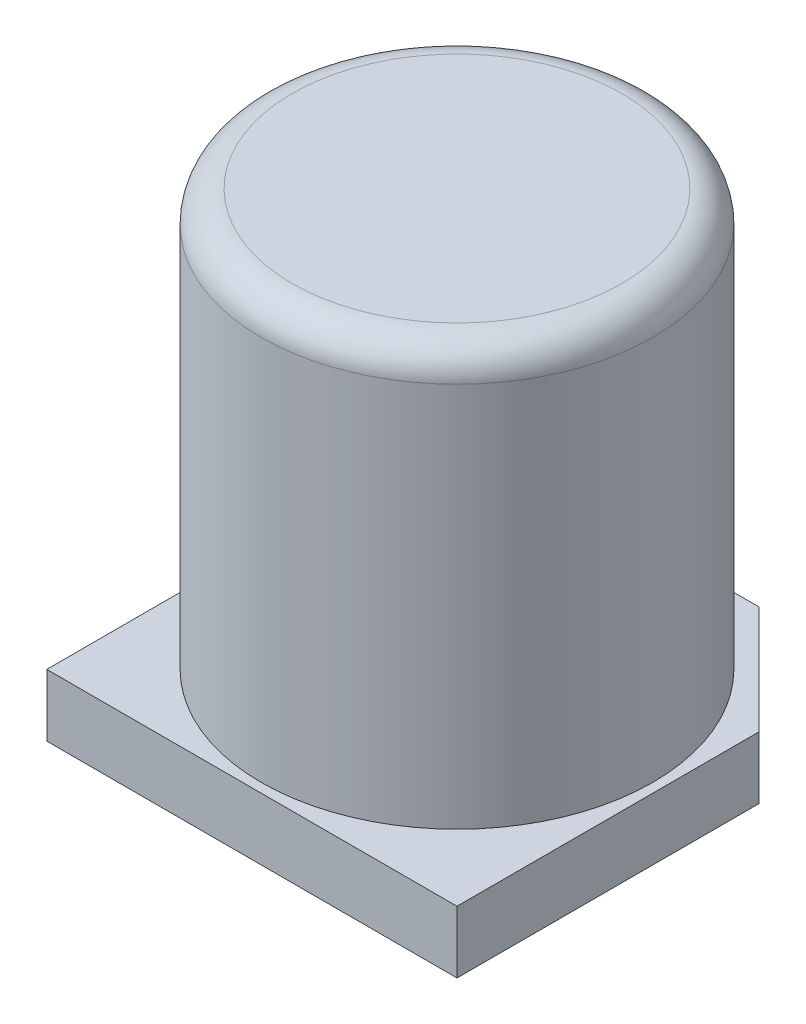
ISO-10303-21;
HEADER;
FILE_DESCRIPTION(('STEP AP214'),'2;1');
FILE_NAME('part.step','',(''),(''),'','','');
FILE_SCHEMA(('AUTOMOTIVE_DESIGN { 1 0 10303 214 1 1 1 1 }'));
ENDSEC;
DATA;
#1=APPLICATION_CONTEXT('core data for automotive mechanical design processes');
#2=APPLICATION_PROTOCOL_DEFINITION('international standard','automotive_design',2000,#1);
#3=PRODUCT_CONTEXT('',#1,'mechanical');
#4=PRODUCT('Part','Part','',(#3));
#5=PRODUCT_RELATED_PRODUCT_CATEGORY('part','',(#4));
#6=PRODUCT_DEFINITION_FORMATION('','',#4);
#7=PRODUCT_DEFINITION_CONTEXT('part definition',#1,'design');
#8=PRODUCT_DEFINITION('design','',#6,#7);
#9=PRODUCT_DEFINITION_SHAPE('','',#8);
#10=(LENGTH_UNIT() NAMED_UNIT(*) SI_UNIT(.MILLI.,.METRE.));
#11=(NAMED_UNIT(*) PLANE_ANGLE_UNIT() SI_UNIT($,.RADIAN.));
#12=(NAMED_UNIT(*) SI_UNIT($,.STERADIAN.) SOLID_ANGLE_UNIT());
#13=UNCERTAINTY_MEASURE_WITH_UNIT(LENGTH_MEASURE(1.E-05),#10,'distance_accuracy_value','');
#14=(GEOMETRIC_REPRESENTATION_CONTEXT(3) GLOBAL_UNCERTAINTY_ASSIGNED_CONTEXT((#13)) GLOBAL_UNIT_ASSIGNED_CONTEXT((#10,
#11,#12)) REPRESENTATION_CONTEXT('',''));
#15=CARTESIAN_POINT('',(0.,0.,0.));
#16=DIRECTION('',(0.,0.,1.));
#17=DIRECTION('',(1.,0.,0.));
#18=AXIS2_PLACEMENT_3D('',#15,#16,#17);
#19=CARTESIAN_POINT('',(-7.40142135623731,1.,0.));
#20=DIRECTION('',(0.,1.,0.));
#21=DIRECTION('',(0.,0.,1.));
#22=AXIS2_PLACEMENT_3D('',#19,#20,#21);
#23=PLANE('',#22);
#24=DIRECTION('',(0.,0.,1.));
#25=VECTOR('',#24,1.);
#26=CARTESIAN_POINT('',(3.3,1.,0.));
#27=LINE('',#26,#25);
#28=CARTESIAN_POINT('',(3.3,1.,-1.56254826892681));
#29=VERTEX_POINT('',#28);
#30=CARTESIAN_POINT('',(3.3,1.,3.3));
#31=VERTEX_POINT('',#30);
#32=EDGE_CURVE('E138',#29,#31,#27,.T.);
#33=ORIENTED_EDGE('',*,*,#32,.F.);
#34=DIRECTION('',(-0.707106781186547,0.,-0.707106781186549));
#35=VECTOR('',#34,1.);
#36=CARTESIAN_POINT('',(-1.26943654365524,1.,-6.13198481258206));
#37=LINE('',#36,#35);
#38=CARTESIAN_POINT('',(1.56254826892681,1.,-3.3));
#39=VERTEX_POINT('',#38);
#40=EDGE_CURVE('E119',#29,#39,#37,.T.);
#41=ORIENTED_EDGE('',*,*,#40,.T.);
#42=DIRECTION('',(1.,0.,0.));
#43=VECTOR('',#42,1.);
#44=CARTESIAN_POINT('',(-7.40142135623731,1.,-3.3));
#45=LINE('',#44,#43);
#46=CARTESIAN_POINT('',(-1.56254826892681,1.,-3.3));
#47=VERTEX_POINT('',#46);
#48=EDGE_CURVE('E117',#47,#39,#45,.T.);
#49=ORIENTED_EDGE('',*,*,#48,.F.);
#50=DIRECTION('',(0.707106781186546,0.,-0.707106781186549));
#51=VECTOR('',#50,1.);
#52=CARTESIAN_POINT('',(-6.13198481258205,1.,1.26943654365525));
#53=LINE('',#52,#51);
#54=CARTESIAN_POINT('',(-3.3,1.,-1.56254826892681));
#55=VERTEX_POINT('',#54);
#56=EDGE_CURVE('E105',#55,#47,#53,.T.);
#57=ORIENTED_EDGE('',*,*,#56,.F.);
#58=DIRECTION('',(0.,0.,1.));
#59=VECTOR('',#58,1.);
#60=CARTESIAN_POINT('',(-3.3,1.,0.));
#61=LINE('',#60,#59);
#62=CARTESIAN_POINT('',(-3.3,1.,3.3));
#63=VERTEX_POINT('',#62);
#64=EDGE_CURVE('E111',#55,#63,#61,.T.);
#65=ORIENTED_EDGE('',*,*,#64,.T.);
#66=DIRECTION('',(1.,0.,0.));
#67=VECTOR('',#66,1.);
#68=CARTESIAN_POINT('',(-7.40142135623731,1.,3.3));
#69=LINE('',#68,#67);
#70=EDGE_CURVE('E56',#63,#31,#69,.T.);
#71=ORIENTED_EDGE('',*,*,#70,.T.);
#72=EDGE_LOOP('',(#33,#41,#49,#57,#65,#71));
#73=FACE_BOUND('',#72,.T.);
#74=CARTESIAN_POINT('',(0.,1.,0.));
#75=DIRECTION('',(0.,1.,0.));
#76=DIRECTION('',(0.,0.,1.));
#77=AXIS2_PLACEMENT_3D('',#74,#75,#76);
#78=CIRCLE('',#77,3.15);
#79=CARTESIAN_POINT('',(0.,1.,3.15));
#80=VERTEX_POINT('',#79);
#81=EDGE_CURVE('E128',#80,#80,#78,.T.);
#82=ORIENTED_EDGE('',*,*,#81,.F.);
#83=EDGE_LOOP('',(#82));
#84=FACE_BOUND('',#83,.T.);
#85=ADVANCED_FACE('F39',(#73,#84),#23,.T.);
#86=CARTESIAN_POINT('',(3.3,1.,0.));
#87=DIRECTION('',(1.,0.,0.));
#88=DIRECTION('',(0.,0.,-1.));
#89=AXIS2_PLACEMENT_3D('',#86,#87,#88);
#90=PLANE('',#89);
#91=DIRECTION('',(0.,0.,1.));
#92=VECTOR('',#91,1.);
#93=CARTESIAN_POINT('',(3.3,0.,0.));
#94=LINE('',#93,#92);
#95=CARTESIAN_POINT('',(3.3,0.,-1.56254826892681));
#96=VERTEX_POINT('',#95);
#97=CARTESIAN_POINT('',(3.3,0.,3.3));
#98=VERTEX_POINT('',#97);
#99=EDGE_CURVE('E124',#96,#98,#94,.T.);
#100=ORIENTED_EDGE('',*,*,#99,.F.);
#101=DIRECTION('',(0.,-1.,0.));
#102=VECTOR('',#101,1.);
#103=CARTESIAN_POINT('',(3.3,1.,-1.56254826892681));
#104=LINE('',#103,#102);
#105=EDGE_CURVE('E90',#29,#96,#104,.T.);
#106=ORIENTED_EDGE('',*,*,#105,.F.);
#107=ORIENTED_EDGE('',*,*,#32,.T.);
#108=DIRECTION('',(0.,-1.,0.));
#109=VECTOR('',#108,1.);
#110=CARTESIAN_POINT('',(3.3,1.,3.3));
#111=LINE('',#110,#109);
#112=EDGE_CURVE('E85',#31,#98,#111,.T.);
#113=ORIENTED_EDGE('',*,*,#112,.T.);
#114=EDGE_LOOP('',(#100,#106,#107,#113));
#115=FACE_BOUND('',#114,.T.);
#116=ADVANCED_FACE('F158',(#115),#90,.T.);
#117=CARTESIAN_POINT('',(-1.26943654365524,1.,-6.13198481258206));
#118=DIRECTION('',(-0.707106781186549,0.,0.707106781186547));
#119=DIRECTION('',(0.707106781186547,0.,0.707106781186549));
#120=AXIS2_PLACEMENT_3D('',#117,#118,#119);
#121=PLANE('',#120);
#122=DIRECTION('',(-0.707106781186547,0.,-0.707106781186549));
#123=VECTOR('',#122,1.);
#124=CARTESIAN_POINT('',(-1.26943654365524,0.,-6.13198481258206));
#125=LINE('',#124,#123);
#126=CARTESIAN_POINT('',(1.56254826892681,0.,-3.3));
#127=VERTEX_POINT('',#126);
#128=EDGE_CURVE('E127',#96,#127,#125,.T.);
#129=ORIENTED_EDGE('',*,*,#128,.T.);
#130=DIRECTION('',(0.,-1.,0.));
#131=VECTOR('',#130,1.);
#132=CARTESIAN_POINT('',(1.56254826892681,1.,-3.3));
#133=LINE('',#132,#131);
#134=EDGE_CURVE('E142',#39,#127,#133,.T.);
#135=ORIENTED_EDGE('',*,*,#134,.F.);
#136=ORIENTED_EDGE('',*,*,#40,.F.);
#137=ORIENTED_EDGE('',*,*,#105,.T.);
#138=EDGE_LOOP('',(#129,#135,#136,#137));
#139=FACE_BOUND('',#138,.T.);
#140=ADVANCED_FACE('F163',(#139),#121,.F.);
#141=CARTESIAN_POINT('',(-7.40142135623731,1.,-3.3));
#142=DIRECTION('',(0.,0.,-1.));
#143=DIRECTION('',(-1.,0.,0.));
#144=AXIS2_PLACEMENT_3D('',#141,#142,#143);
#145=PLANE('',#144);
#146=DIRECTION('',(1.,0.,0.));
#147=VECTOR('',#146,1.);
#148=CARTESIAN_POINT('',(-7.40142135623731,0.,-3.3));
#149=LINE('',#148,#147);
#150=CARTESIAN_POINT('',(-1.56254826892681,0.,-3.3));
#151=VERTEX_POINT('',#150);
#152=EDGE_CURVE('E131',#151,#127,#149,.T.);
#153=ORIENTED_EDGE('',*,*,#152,.F.);
#154=DIRECTION('',(0.,-1.,0.));
#155=VECTOR('',#154,1.);
#156=CARTESIAN_POINT('',(-1.56254826892681,1.,-3.3));
#157=LINE('',#156,#155);
#158=EDGE_CURVE('E108',#47,#151,#157,.T.);
#159=ORIENTED_EDGE('',*,*,#158,.F.);
#160=ORIENTED_EDGE('',*,*,#48,.T.);
#161=ORIENTED_EDGE('',*,*,#134,.T.);
#162=EDGE_LOOP('',(#153,#159,#160,#161));
#163=FACE_BOUND('',#162,.T.);
#164=ADVANCED_FACE('F178',(#163),#145,.T.);
#165=CARTESIAN_POINT('',(-6.13198481258205,1.,1.26943654365525));
#166=DIRECTION('',(-0.707106781186549,0.,-0.707106781186546));
#167=DIRECTION('',(-0.707106781186546,0.,0.707106781186549));
#168=AXIS2_PLACEMENT_3D('',#165,#166,#167);
#169=PLANE('',#168);
#170=DIRECTION('',(0.707106781186546,0.,-0.707106781186549));
#171=VECTOR('',#170,1.);
#172=CARTESIAN_POINT('',(-6.13198481258205,0.,1.26943654365525));
#173=LINE('',#172,#171);
#174=CARTESIAN_POINT('',(-3.3,0.,-1.56254826892681));
#175=VERTEX_POINT('',#174);
#176=EDGE_CURVE('E107',#175,#151,#173,.T.);
#177=ORIENTED_EDGE('',*,*,#176,.F.);
#178=DIRECTION('',(0.,-1.,0.));
#179=VECTOR('',#178,1.);
#180=CARTESIAN_POINT('',(-3.3,1.,-1.56254826892681));
#181=LINE('',#180,#179);
#182=EDGE_CURVE('E101',#55,#175,#181,.T.);
#183=ORIENTED_EDGE('',*,*,#182,.F.);
#184=ORIENTED_EDGE('',*,*,#56,.T.);
#185=ORIENTED_EDGE('',*,*,#158,.T.);
#186=EDGE_LOOP('',(#177,#183,#184,#185));
#187=FACE_BOUND('',#186,.T.);
#188=ADVANCED_FACE('F103',(#187),#169,.T.);
#189=CARTESIAN_POINT('',(-3.3,1.,0.));
#190=DIRECTION('',(1.,0.,0.));
#191=DIRECTION('',(0.,0.,-1.));
#192=AXIS2_PLACEMENT_3D('',#189,#190,#191);
#193=PLANE('',#192);
#194=DIRECTION('',(0.,0.,1.));
#195=VECTOR('',#194,1.);
#196=CARTESIAN_POINT('',(-3.3,0.,0.));
#197=LINE('',#196,#195);
#198=CARTESIAN_POINT('',(-3.3,0.,3.3));
#199=VERTEX_POINT('',#198);
#200=EDGE_CURVE('E78',#175,#199,#197,.T.);
#201=ORIENTED_EDGE('',*,*,#200,.T.);
#202=DIRECTION('',(0.,-1.,0.));
#203=VECTOR('',#202,1.);
#204=CARTESIAN_POINT('',(-3.3,1.,3.3));
#205=LINE('',#204,#203);
#206=EDGE_CURVE('E109',#63,#199,#205,.T.);
#207=ORIENTED_EDGE('',*,*,#206,.F.);
#208=ORIENTED_EDGE('',*,*,#64,.F.);
#209=ORIENTED_EDGE('',*,*,#182,.T.);
#210=EDGE_LOOP('',(#201,#207,#208,#209));
#211=FACE_BOUND('',#210,.T.);
#212=ADVANCED_FACE('F112',(#211),#193,.F.);
#213=CARTESIAN_POINT('',(-7.40142135623731,1.,3.3));
#214=DIRECTION('',(0.,0.,-1.));
#215=DIRECTION('',(-1.,0.,0.));
#216=AXIS2_PLACEMENT_3D('',#213,#214,#215);
#217=PLANE('',#216);
#218=DIRECTION('',(1.,0.,0.));
#219=VECTOR('',#218,1.);
#220=CARTESIAN_POINT('',(-7.40142135623731,0.,3.3));
#221=LINE('',#220,#219);
#222=EDGE_CURVE('E136',#199,#98,#221,.T.);
#223=ORIENTED_EDGE('',*,*,#222,.T.);
#224=ORIENTED_EDGE('',*,*,#112,.F.);
#225=ORIENTED_EDGE('',*,*,#70,.F.);
#226=ORIENTED_EDGE('',*,*,#206,.T.);
#227=EDGE_LOOP('',(#223,#224,#225,#226));
#228=FACE_BOUND('',#227,.T.);
#229=ADVANCED_FACE('F169',(#228),#217,.F.);
#230=CARTESIAN_POINT('',(-7.40142135623731,0.,0.));
#231=DIRECTION('',(0.,1.,0.));
#232=DIRECTION('',(0.,0.,1.));
#233=AXIS2_PLACEMENT_3D('',#230,#231,#232);
#234=PLANE('',#233);
#235=ORIENTED_EDGE('',*,*,#99,.T.);
#236=ORIENTED_EDGE('',*,*,#222,.F.);
#237=ORIENTED_EDGE('',*,*,#200,.F.);
#238=ORIENTED_EDGE('',*,*,#176,.T.);
#239=ORIENTED_EDGE('',*,*,#152,.T.);
#240=ORIENTED_EDGE('',*,*,#128,.F.);
#241=EDGE_LOOP('',(#235,#236,#237,#238,#239,#240));
#242=FACE_BOUND('',#241,.T.);
#243=ADVANCED_FACE('F166',(#242),#234,.F.);
#244=CARTESIAN_POINT('',(0.,7.7,0.));
#245=DIRECTION('',(0.,-1.,0.));
#246=DIRECTION('',(0.,0.,-1.));
#247=AXIS2_PLACEMENT_3D('',#244,#245,#246);
#248=CYLINDRICAL_SURFACE('',#247,3.15);
#249=CARTESIAN_POINT('',(0.,7.2,0.));
#250=DIRECTION('',(0.,1.,0.));
#251=DIRECTION('',(0.,0.,1.));
#252=AXIS2_PLACEMENT_3D('',#249,#250,#251);
#253=CIRCLE('',#252,3.15);
#254=CARTESIAN_POINT('',(0.,7.2,3.15));
#255=VERTEX_POINT('',#254);
#256=EDGE_CURVE('E11',#255,#255,#253,.F.);
#257=ORIENTED_EDGE('',*,*,#256,.T.);
#258=EDGE_LOOP('',(#257));
#259=FACE_BOUND('',#258,.T.);
#260=ORIENTED_EDGE('',*,*,#81,.T.);
#261=EDGE_LOOP('',(#260));
#262=FACE_BOUND('',#261,.T.);
#263=ADVANCED_FACE('F154',(#259,#262),#248,.T.);
#264=CARTESIAN_POINT('',(0.,7.7,0.));
#265=DIRECTION('',(0.,1.,0.));
#266=DIRECTION('',(0.,0.,1.));
#267=AXIS2_PLACEMENT_3D('',#264,#265,#266);
#268=PLANE('',#267);
#269=CARTESIAN_POINT('',(0.,7.7,0.));
#270=DIRECTION('',(0.,1.,0.));
#271=DIRECTION('',(0.,0.,1.));
#272=AXIS2_PLACEMENT_3D('',#269,#270,#271);
#273=CIRCLE('',#272,2.65);
#274=CARTESIAN_POINT('',(0.,7.7,2.65));
#275=VERTEX_POINT('',#274);
#276=EDGE_CURVE('E48',#275,#275,#273,.T.);
#277=ORIENTED_EDGE('',*,*,#276,.T.);
#278=EDGE_LOOP('',(#277));
#279=FACE_BOUND('',#278,.T.);
#280=ADVANCED_FACE('F147',(#279),#268,.T.);
#281=CARTESIAN_POINT('',(0.,7.2,0.));
#282=DIRECTION('',(0.,1.,0.));
#283=DIRECTION('',(0.,0.,1.));
#284=AXIS2_PLACEMENT_3D('',#281,#282,#283);
#285=TOROIDAL_SURFACE('',#284,2.65,0.5);
#286=ORIENTED_EDGE('',*,*,#256,.F.);
#287=EDGE_LOOP('',(#286));
#288=FACE_BOUND('',#287,.T.);
#289=ORIENTED_EDGE('',*,*,#276,.F.);
#290=EDGE_LOOP('',(#289));
#291=FACE_BOUND('',#290,.T.);
#292=ADVANCED_FACE('F41',(#288,#291),#285,.T.);
#293=CLOSED_SHELL('',(#85,#116,#140,#164,#188,#212,#229,#243,#263,#280,#292));
#294=MANIFOLD_SOLID_BREP('B2',#293);
#295=ADVANCED_BREP_SHAPE_REPRESENTATION('',(#18,#294),#14);
#296=SHAPE_DEFINITION_REPRESENTATION(#9,#295);
ENDSEC;
END-ISO-10303-21;
